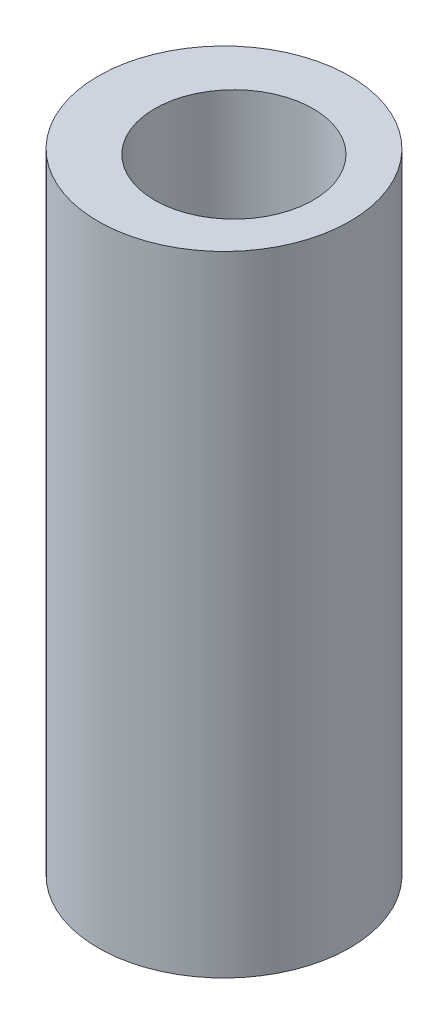
ISO-10303-21;
HEADER;
FILE_DESCRIPTION(('STEP AP214'),'2;1');
FILE_NAME('part.step','',(''),(''),'','','');
FILE_SCHEMA(('AUTOMOTIVE_DESIGN { 1 0 10303 214 1 1 1 1 }'));
ENDSEC;
DATA;
#1=APPLICATION_CONTEXT('core data for automotive mechanical design processes');
#2=APPLICATION_PROTOCOL_DEFINITION('international standard','automotive_design',2000,#1);
#3=PRODUCT_CONTEXT('',#1,'mechanical');
#4=PRODUCT('Part','Part','',(#3));
#5=PRODUCT_RELATED_PRODUCT_CATEGORY('part','',(#4));
#6=PRODUCT_DEFINITION_FORMATION('','',#4);
#7=PRODUCT_DEFINITION_CONTEXT('part definition',#1,'design');
#8=PRODUCT_DEFINITION('design','',#6,#7);
#9=PRODUCT_DEFINITION_SHAPE('','',#8);
#10=(LENGTH_UNIT() NAMED_UNIT(*) SI_UNIT(.MILLI.,.METRE.));
#11=(NAMED_UNIT(*) PLANE_ANGLE_UNIT() SI_UNIT($,.RADIAN.));
#12=(NAMED_UNIT(*) SI_UNIT($,.STERADIAN.) SOLID_ANGLE_UNIT());
#13=UNCERTAINTY_MEASURE_WITH_UNIT(LENGTH_MEASURE(1.E-05),#10,'distance_accuracy_value','');
#14=(GEOMETRIC_REPRESENTATION_CONTEXT(3) GLOBAL_UNCERTAINTY_ASSIGNED_CONTEXT((#13)) GLOBAL_UNIT_ASSIGNED_CONTEXT((#10,
#11,#12)) REPRESENTATION_CONTEXT('',''));
#15=CARTESIAN_POINT('',(0.,0.,0.));
#16=DIRECTION('',(0.,0.,1.));
#17=DIRECTION('',(1.,0.,0.));
#18=AXIS2_PLACEMENT_3D('',#15,#16,#17);
#19=CARTESIAN_POINT('',(0.,-15.875,0.));
#20=DIRECTION('',(0.,1.,0.));
#21=DIRECTION('',(-1.,0.,0.));
#22=AXIS2_PLACEMENT_3D('',#19,#20,#21);
#23=PLANE('',#22);
#24=CARTESIAN_POINT('',(0.5,-15.875,0.));
#25=DIRECTION('',(0.,1.,0.));
#26=DIRECTION('',(0.,0.,1.));
#27=AXIS2_PLACEMENT_3D('',#24,#25,#26);
#28=CIRCLE('',#27,4.);
#29=CARTESIAN_POINT('',(0.5,-15.875,4.));
#30=VERTEX_POINT('',#29);
#31=EDGE_CURVE('E78',#30,#30,#28,.T.);
#32=ORIENTED_EDGE('',*,*,#31,.T.);
#33=EDGE_LOOP('',(#32));
#34=FACE_BOUND('',#33,.T.);
#35=CARTESIAN_POINT('',(0.,-15.875,0.));
#36=DIRECTION('',(0.,1.,0.));
#37=DIRECTION('',(-1.,0.,0.));
#38=AXIS2_PLACEMENT_3D('',#35,#36,#37);
#39=CIRCLE('',#38,6.35);
#40=CARTESIAN_POINT('',(-6.35,-15.875,0.));
#41=VERTEX_POINT('',#40);
#42=EDGE_CURVE('E10',#41,#41,#39,.T.);
#43=ORIENTED_EDGE('',*,*,#42,.F.);
#44=EDGE_LOOP('',(#43));
#45=FACE_BOUND('',#44,.T.);
#46=ADVANCED_FACE('F43',(#34,#45),#23,.F.);
#47=CARTESIAN_POINT('',(0.,7.56397058823529,0.));
#48=DIRECTION('',(0.,1.,0.));
#49=DIRECTION('',(-1.,0.,0.));
#50=AXIS2_PLACEMENT_3D('',#47,#48,#49);
#51=CYLINDRICAL_SURFACE('',#50,6.35);
#52=CARTESIAN_POINT('',(0.,15.875,0.));
#53=DIRECTION('',(0.,1.,0.));
#54=DIRECTION('',(-1.,0.,0.));
#55=AXIS2_PLACEMENT_3D('',#52,#53,#54);
#56=CIRCLE('',#55,6.35);
#57=CARTESIAN_POINT('',(-6.35,15.875,0.));
#58=VERTEX_POINT('',#57);
#59=EDGE_CURVE('E50',#58,#58,#56,.T.);
#60=ORIENTED_EDGE('',*,*,#59,.F.);
#61=EDGE_LOOP('',(#60));
#62=FACE_BOUND('',#61,.T.);
#63=ORIENTED_EDGE('',*,*,#42,.T.);
#64=EDGE_LOOP('',(#63));
#65=FACE_BOUND('',#64,.T.);
#66=ADVANCED_FACE('F97',(#62,#65),#51,.T.);
#67=CARTESIAN_POINT('',(0.,15.875,0.));
#68=DIRECTION('',(0.,-1.,0.));
#69=DIRECTION('',(1.,0.,0.));
#70=AXIS2_PLACEMENT_3D('',#67,#68,#69);
#71=PLANE('',#70);
#72=CARTESIAN_POINT('',(0.5,15.875,0.));
#73=DIRECTION('',(0.,1.,0.));
#74=DIRECTION('',(0.,0.,1.));
#75=AXIS2_PLACEMENT_3D('',#72,#73,#74);
#76=CIRCLE('',#75,4.);
#77=CARTESIAN_POINT('',(0.5,15.875,4.));
#78=VERTEX_POINT('',#77);
#79=EDGE_CURVE('E55',#78,#78,#76,.T.);
#80=ORIENTED_EDGE('',*,*,#79,.F.);
#81=EDGE_LOOP('',(#80));
#82=FACE_BOUND('',#81,.T.);
#83=ORIENTED_EDGE('',*,*,#59,.T.);
#84=EDGE_LOOP('',(#83));
#85=FACE_BOUND('',#84,.T.);
#86=ADVANCED_FACE('F102',(#82,#85),#71,.F.);
#87=CARTESIAN_POINT('',(0.5,-7.98232211299692,0.));
#88=DIRECTION('',(0.,1.,0.));
#89=DIRECTION('',(0.,0.,1.));
#90=AXIS2_PLACEMENT_3D('',#87,#88,#89);
#91=CYLINDRICAL_SURFACE('',#90,4.);
#92=ORIENTED_EDGE('',*,*,#79,.T.);
#93=EDGE_LOOP('',(#92));
#94=FACE_BOUND('',#93,.T.);
#95=CARTESIAN_POINT('',(0.5,9.875,0.));
#96=DIRECTION('',(0.,1.,0.));
#97=DIRECTION('',(0.,0.,1.));
#98=AXIS2_PLACEMENT_3D('',#95,#96,#97);
#99=CIRCLE('',#98,4.);
#100=CARTESIAN_POINT('',(0.5,9.875,4.));
#101=VERTEX_POINT('',#100);
#102=EDGE_CURVE('E60',#101,#101,#99,.T.);
#103=ORIENTED_EDGE('',*,*,#102,.F.);
#104=EDGE_LOOP('',(#103));
#105=FACE_BOUND('',#104,.T.);
#106=ADVANCED_FACE('F106',(#94,#105),#91,.F.);
#107=CARTESIAN_POINT('',(4.5,9.875,0.));
#108=DIRECTION('',(0.,1.,0.));
#109=DIRECTION('',(0.,0.,1.));
#110=AXIS2_PLACEMENT_3D('',#107,#108,#109);
#111=PLANE('',#110);
#112=ORIENTED_EDGE('',*,*,#102,.T.);
#113=EDGE_LOOP('',(#112));
#114=FACE_BOUND('',#113,.T.);
#115=CARTESIAN_POINT('',(0.5,9.875,0.));
#116=DIRECTION('',(0.,1.,0.));
#117=DIRECTION('',(0.,0.,1.));
#118=AXIS2_PLACEMENT_3D('',#115,#116,#117);
#119=CIRCLE('',#118,3.);
#120=CARTESIAN_POINT('',(0.5,9.875,3.));
#121=VERTEX_POINT('',#120);
#122=EDGE_CURVE('E66',#121,#121,#119,.T.);
#123=ORIENTED_EDGE('',*,*,#122,.F.);
#124=EDGE_LOOP('',(#123));
#125=FACE_BOUND('',#124,.T.);
#126=ADVANCED_FACE('F112',(#114,#125),#111,.T.);
#127=CARTESIAN_POINT('',(0.5,-7.98232211299692,0.));
#128=DIRECTION('',(0.,1.,0.));
#129=DIRECTION('',(0.,0.,1.));
#130=AXIS2_PLACEMENT_3D('',#127,#128,#129);
#131=CYLINDRICAL_SURFACE('',#130,3.);
#132=ORIENTED_EDGE('',*,*,#122,.T.);
#133=EDGE_LOOP('',(#132));
#134=FACE_BOUND('',#133,.T.);
#135=CARTESIAN_POINT('',(0.5,-9.875,0.));
#136=DIRECTION('',(0.,1.,0.));
#137=DIRECTION('',(0.,0.,1.));
#138=AXIS2_PLACEMENT_3D('',#135,#136,#137);
#139=CIRCLE('',#138,3.);
#140=CARTESIAN_POINT('',(0.5,-9.875,3.));
#141=VERTEX_POINT('',#140);
#142=EDGE_CURVE('E70',#141,#141,#139,.T.);
#143=ORIENTED_EDGE('',*,*,#142,.F.);
#144=EDGE_LOOP('',(#143));
#145=FACE_BOUND('',#144,.T.);
#146=ADVANCED_FACE('F93',(#134,#145),#131,.F.);
#147=CARTESIAN_POINT('',(3.5,-9.875,0.));
#148=DIRECTION('',(0.,-1.,0.));
#149=DIRECTION('',(0.,0.,-1.));
#150=AXIS2_PLACEMENT_3D('',#147,#148,#149);
#151=PLANE('',#150);
#152=ORIENTED_EDGE('',*,*,#142,.T.);
#153=EDGE_LOOP('',(#152));
#154=FACE_BOUND('',#153,.T.);
#155=CARTESIAN_POINT('',(0.5,-9.875,0.));
#156=DIRECTION('',(0.,1.,0.));
#157=DIRECTION('',(0.,0.,1.));
#158=AXIS2_PLACEMENT_3D('',#155,#156,#157);
#159=CIRCLE('',#158,4.);
#160=CARTESIAN_POINT('',(0.5,-9.875,4.));
#161=VERTEX_POINT('',#160);
#162=EDGE_CURVE('E74',#161,#161,#159,.T.);
#163=ORIENTED_EDGE('',*,*,#162,.F.);
#164=EDGE_LOOP('',(#163));
#165=FACE_BOUND('',#164,.T.);
#166=ADVANCED_FACE('F87',(#154,#165),#151,.T.);
#167=CARTESIAN_POINT('',(0.5,-7.98232211299692,0.));
#168=DIRECTION('',(0.,1.,0.));
#169=DIRECTION('',(0.,0.,1.));
#170=AXIS2_PLACEMENT_3D('',#167,#168,#169);
#171=CYLINDRICAL_SURFACE('',#170,4.);
#172=ORIENTED_EDGE('',*,*,#162,.T.);
#173=EDGE_LOOP('',(#172));
#174=FACE_BOUND('',#173,.T.);
#175=ORIENTED_EDGE('',*,*,#31,.F.);
#176=EDGE_LOOP('',(#175));
#177=FACE_BOUND('',#176,.T.);
#178=ADVANCED_FACE('F85',(#174,#177),#171,.F.);
#179=CLOSED_SHELL('',(#46,#66,#86,#106,#126,#146,#166,#178));
#180=MANIFOLD_SOLID_BREP('B2',#179);
#181=ADVANCED_BREP_SHAPE_REPRESENTATION('',(#18,#180),#14);
#182=SHAPE_DEFINITION_REPRESENTATION(#9,#181);
ENDSEC;
END-ISO-10303-21;
